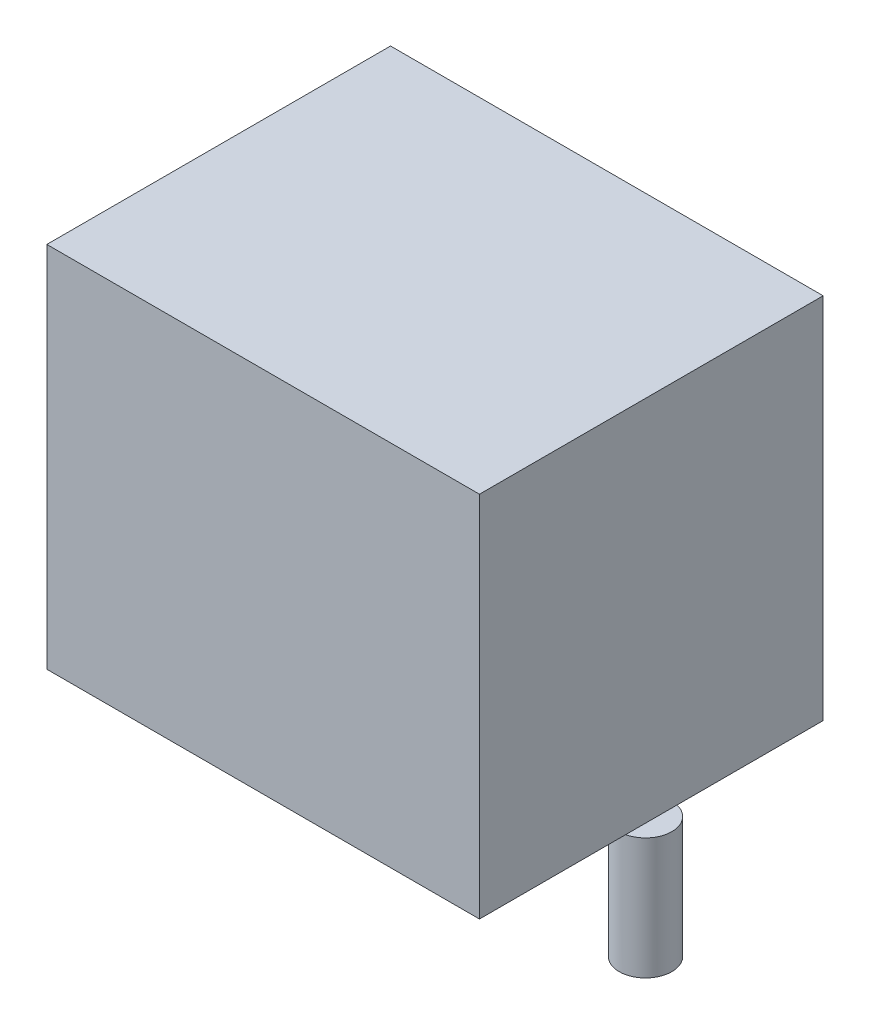
ISO-10303-21;
HEADER;
FILE_DESCRIPTION(('STEP AP214'),'2;1');
FILE_NAME('part.step','',(''),(''),'','','');
FILE_SCHEMA(('AUTOMOTIVE_DESIGN { 1 0 10303 214 1 1 1 1 }'));
ENDSEC;
DATA;
#1=APPLICATION_CONTEXT('core data for automotive mechanical design processes');
#2=APPLICATION_PROTOCOL_DEFINITION('international standard','automotive_design',2000,#1);
#3=PRODUCT_CONTEXT('',#1,'mechanical');
#4=PRODUCT('Part','Part','',(#3));
#5=PRODUCT_RELATED_PRODUCT_CATEGORY('part','',(#4));
#6=PRODUCT_DEFINITION_FORMATION('','',#4);
#7=PRODUCT_DEFINITION_CONTEXT('part definition',#1,'design');
#8=PRODUCT_DEFINITION('design','',#6,#7);
#9=PRODUCT_DEFINITION_SHAPE('','',#8);
#10=(LENGTH_UNIT() NAMED_UNIT(*) SI_UNIT(.MILLI.,.METRE.));
#11=(NAMED_UNIT(*) PLANE_ANGLE_UNIT() SI_UNIT($,.RADIAN.));
#12=(NAMED_UNIT(*) SI_UNIT($,.STERADIAN.) SOLID_ANGLE_UNIT());
#13=UNCERTAINTY_MEASURE_WITH_UNIT(LENGTH_MEASURE(1.E-05),#10,'distance_accuracy_value','');
#14=(GEOMETRIC_REPRESENTATION_CONTEXT(3) GLOBAL_UNCERTAINTY_ASSIGNED_CONTEXT((#13)) GLOBAL_UNIT_ASSIGNED_CONTEXT((#10,
#11,#12)) REPRESENTATION_CONTEXT('',''));
#15=CARTESIAN_POINT('',(0.,0.,0.));
#16=DIRECTION('',(0.,0.,1.));
#17=DIRECTION('',(1.,0.,0.));
#18=AXIS2_PLACEMENT_3D('',#15,#16,#17);
#19=CARTESIAN_POINT('',(-5.207,-3.,0.));
#20=DIRECTION('',(0.,-1.,0.));
#21=DIRECTION('',(0.,0.,-1.));
#22=AXIS2_PLACEMENT_3D('',#19,#20,#21);
#23=PLANE('',#22);
#24=CARTESIAN_POINT('',(-5.207,-3.,0.));
#25=DIRECTION('',(0.,1.,0.));
#26=DIRECTION('',(0.,0.,1.));
#27=AXIS2_PLACEMENT_3D('',#24,#25,#26);
#28=CIRCLE('',#27,0.650000000000002);
#29=CARTESIAN_POINT('',(-5.207,-3.,0.649999999999988));
#30=VERTEX_POINT('',#29);
#31=EDGE_CURVE('E80',#30,#30,#28,.T.);
#32=ORIENTED_EDGE('',*,*,#31,.F.);
#33=EDGE_LOOP('',(#32));
#34=FACE_BOUND('',#33,.T.);
#35=ADVANCED_FACE('F17',(#34),#23,.T.);
#36=CARTESIAN_POINT('',(5.20700000000003,-3.,0.));
#37=DIRECTION('',(0.,-1.,0.));
#38=DIRECTION('',(0.,0.,-1.));
#39=AXIS2_PLACEMENT_3D('',#36,#37,#38);
#40=PLANE('',#39);
#41=CARTESIAN_POINT('',(5.20700000000003,-3.,0.));
#42=DIRECTION('',(0.,1.,0.));
#43=DIRECTION('',(0.,0.,1.));
#44=AXIS2_PLACEMENT_3D('',#41,#42,#43);
#45=CIRCLE('',#44,0.650000000000002);
#46=CARTESIAN_POINT('',(5.20700000000003,-3.,0.650000000000002));
#47=VERTEX_POINT('',#46);
#48=EDGE_CURVE('E125',#47,#47,#45,.T.);
#49=ORIENTED_EDGE('',*,*,#48,.F.);
#50=EDGE_LOOP('',(#49));
#51=FACE_BOUND('',#50,.T.);
#52=ADVANCED_FACE('F159',(#51),#40,.T.);
#53=CARTESIAN_POINT('',(5.20700000000003,0.,0.));
#54=DIRECTION('',(0.,-1.,0.));
#55=DIRECTION('',(0.,0.,-1.));
#56=AXIS2_PLACEMENT_3D('',#53,#54,#55);
#57=PLANE('',#56);
#58=CARTESIAN_POINT('',(5.20700000000003,0.,0.));
#59=DIRECTION('',(0.,1.,0.));
#60=DIRECTION('',(0.,0.,1.));
#61=AXIS2_PLACEMENT_3D('',#58,#59,#60);
#62=CIRCLE('',#61,0.650000000000002);
#63=CARTESIAN_POINT('',(5.35,0.,-0.634074916709383));
#64=VERTEX_POINT('',#63);
#65=CARTESIAN_POINT('',(5.35,0.,0.634074916709376));
#66=VERTEX_POINT('',#65);
#67=EDGE_CURVE('E20',#64,#66,#62,.F.);
#68=ORIENTED_EDGE('',*,*,#67,.F.);
#69=DIRECTION('',(0.,0.,1.));
#70=VECTOR('',#69,1.);
#71=CARTESIAN_POINT('',(5.35000000000001,0.,-4.25000000000001));
#72=LINE('',#71,#70);
#73=EDGE_CURVE('E116',#64,#66,#72,.T.);
#74=ORIENTED_EDGE('',*,*,#73,.T.);
#75=EDGE_LOOP('',(#68,#74));
#76=FACE_BOUND('',#75,.T.);
#77=ADVANCED_FACE('F164',(#76),#57,.F.);
#78=CARTESIAN_POINT('',(-5.207,0.,0.));
#79=DIRECTION('',(0.,-1.,0.));
#80=DIRECTION('',(0.,0.,-1.));
#81=AXIS2_PLACEMENT_3D('',#78,#79,#80);
#82=PLANE('',#81);
#83=DIRECTION('',(0.,0.,-1.));
#84=VECTOR('',#83,1.);
#85=CARTESIAN_POINT('',(-5.35000000000001,0.,-4.25000000000001));
#86=LINE('',#85,#84);
#87=CARTESIAN_POINT('',(-5.35,0.,0.634074916709363));
#88=VERTEX_POINT('',#87);
#89=CARTESIAN_POINT('',(-5.35000000000001,0.,-0.634074916709388));
#90=VERTEX_POINT('',#89);
#91=EDGE_CURVE('E72',#88,#90,#86,.T.);
#92=ORIENTED_EDGE('',*,*,#91,.T.);
#93=CARTESIAN_POINT('',(-5.207,0.,0.));
#94=DIRECTION('',(0.,1.,0.));
#95=DIRECTION('',(0.,0.,1.));
#96=AXIS2_PLACEMENT_3D('',#93,#94,#95);
#97=CIRCLE('',#96,0.650000000000002);
#98=EDGE_CURVE('E74',#88,#90,#97,.F.);
#99=ORIENTED_EDGE('',*,*,#98,.F.);
#100=EDGE_LOOP('',(#92,#99));
#101=FACE_BOUND('',#100,.T.);
#102=ADVANCED_FACE('F81',(#101),#82,.F.);
#103=CARTESIAN_POINT('',(-5.207,-3.,0.));
#104=DIRECTION('',(0.,1.,0.));
#105=DIRECTION('',(0.,0.,1.));
#106=AXIS2_PLACEMENT_3D('',#103,#104,#105);
#107=CYLINDRICAL_SURFACE('',#106,0.650000000000002);
#108=ORIENTED_EDGE('',*,*,#98,.T.);
#109=CARTESIAN_POINT('',(-5.207,0.,0.));
#110=DIRECTION('',(0.,1.,0.));
#111=DIRECTION('',(0.,0.,1.));
#112=AXIS2_PLACEMENT_3D('',#109,#110,#111);
#113=CIRCLE('',#112,0.650000000000002);
#114=EDGE_CURVE('E64',#90,#88,#113,.F.);
#115=ORIENTED_EDGE('',*,*,#114,.T.);
#116=EDGE_LOOP('',(#108,#115));
#117=FACE_BOUND('',#116,.T.);
#118=ORIENTED_EDGE('',*,*,#31,.T.);
#119=EDGE_LOOP('',(#118));
#120=FACE_BOUND('',#119,.T.);
#121=ADVANCED_FACE('F76',(#117,#120),#107,.T.);
#122=CARTESIAN_POINT('',(-5.35000000000001,9.1,4.25));
#123=DIRECTION('',(0.,0.,-1.));
#124=DIRECTION('',(-1.,0.,0.));
#125=AXIS2_PLACEMENT_3D('',#122,#123,#124);
#126=PLANE('',#125);
#127=DIRECTION('',(0.,1.,0.));
#128=VECTOR('',#127,1.);
#129=CARTESIAN_POINT('',(5.35,9.1,4.25));
#130=LINE('',#129,#128);
#131=CARTESIAN_POINT('',(5.35,0.,4.25));
#132=VERTEX_POINT('',#131);
#133=CARTESIAN_POINT('',(5.35,9.1,4.25));
#134=VERTEX_POINT('',#133);
#135=EDGE_CURVE('E119',#132,#134,#130,.T.);
#136=ORIENTED_EDGE('',*,*,#135,.T.);
#137=DIRECTION('',(1.,0.,0.));
#138=VECTOR('',#137,1.);
#139=CARTESIAN_POINT('',(-5.35000000000001,9.1,4.25));
#140=LINE('',#139,#138);
#141=CARTESIAN_POINT('',(-5.35000000000001,9.1,4.25));
#142=VERTEX_POINT('',#141);
#143=EDGE_CURVE('E118',#142,#134,#140,.T.);
#144=ORIENTED_EDGE('',*,*,#143,.F.);
#145=DIRECTION('',(0.,1.,0.));
#146=VECTOR('',#145,1.);
#147=CARTESIAN_POINT('',(-5.35000000000001,9.1,4.25));
#148=LINE('',#147,#146);
#149=CARTESIAN_POINT('',(-5.35,0.,4.25));
#150=VERTEX_POINT('',#149);
#151=EDGE_CURVE('E83',#142,#150,#148,.F.);
#152=ORIENTED_EDGE('',*,*,#151,.T.);
#153=DIRECTION('',(1.,0.,0.));
#154=VECTOR('',#153,1.);
#155=CARTESIAN_POINT('',(-5.35000000000001,0.,4.25));
#156=LINE('',#155,#154);
#157=EDGE_CURVE('E105',#150,#132,#156,.T.);
#158=ORIENTED_EDGE('',*,*,#157,.T.);
#159=EDGE_LOOP('',(#136,#144,#152,#158));
#160=FACE_BOUND('',#159,.T.);
#161=ADVANCED_FACE('F188',(#160),#126,.F.);
#162=CARTESIAN_POINT('',(5.20700000000003,-3.,0.));
#163=DIRECTION('',(0.,1.,0.));
#164=DIRECTION('',(0.,0.,1.));
#165=AXIS2_PLACEMENT_3D('',#162,#163,#164);
#166=CYLINDRICAL_SURFACE('',#165,0.650000000000002);
#167=ORIENTED_EDGE('',*,*,#48,.T.);
#168=EDGE_LOOP('',(#167));
#169=FACE_BOUND('',#168,.T.);
#170=CARTESIAN_POINT('',(5.20700000000003,0.,0.));
#171=DIRECTION('',(0.,1.,0.));
#172=DIRECTION('',(0.,0.,1.));
#173=AXIS2_PLACEMENT_3D('',#170,#171,#172);
#174=CIRCLE('',#173,0.650000000000002);
#175=EDGE_CURVE('E95',#66,#64,#174,.F.);
#176=ORIENTED_EDGE('',*,*,#175,.T.);
#177=ORIENTED_EDGE('',*,*,#67,.T.);
#178=EDGE_LOOP('',(#176,#177));
#179=FACE_BOUND('',#178,.T.);
#180=ADVANCED_FACE('F184',(#169,#179),#166,.T.);
#181=CARTESIAN_POINT('',(5.35000000000001,9.1,-4.25000000000001));
#182=DIRECTION('',(-1.,0.,0.));
#183=DIRECTION('',(0.,0.,1.));
#184=AXIS2_PLACEMENT_3D('',#181,#182,#183);
#185=PLANE('',#184);
#186=ORIENTED_EDGE('',*,*,#73,.F.);
#187=DIRECTION('',(0.,0.,1.));
#188=VECTOR('',#187,1.);
#189=CARTESIAN_POINT('',(5.34999999999999,0.,4.25));
#190=LINE('',#189,#188);
#191=CARTESIAN_POINT('',(5.35,0.,-4.25000000000001));
#192=VERTEX_POINT('',#191);
#193=EDGE_CURVE('E89',#64,#192,#190,.F.);
#194=ORIENTED_EDGE('',*,*,#193,.T.);
#195=DIRECTION('',(0.,1.,0.));
#196=VECTOR('',#195,1.);
#197=CARTESIAN_POINT('',(5.35000000000001,9.1,-4.25000000000001));
#198=LINE('',#197,#196);
#199=CARTESIAN_POINT('',(5.35,9.1,-4.25000000000001));
#200=VERTEX_POINT('',#199);
#201=EDGE_CURVE('E88',#192,#200,#198,.T.);
#202=ORIENTED_EDGE('',*,*,#201,.T.);
#203=DIRECTION('',(0.,0.,1.));
#204=VECTOR('',#203,1.);
#205=CARTESIAN_POINT('',(5.34999999999999,9.1,4.25));
#206=LINE('',#205,#204);
#207=EDGE_CURVE('E138',#134,#200,#206,.F.);
#208=ORIENTED_EDGE('',*,*,#207,.F.);
#209=ORIENTED_EDGE('',*,*,#135,.F.);
#210=DIRECTION('',(0.,0.,1.));
#211=VECTOR('',#210,1.);
#212=CARTESIAN_POINT('',(5.34999999999999,0.,4.25));
#213=LINE('',#212,#211);
#214=EDGE_CURVE('E102',#132,#66,#213,.F.);
#215=ORIENTED_EDGE('',*,*,#214,.T.);
#216=EDGE_LOOP('',(#186,#194,#202,#208,#209,#215));
#217=FACE_BOUND('',#216,.T.);
#218=ADVANCED_FACE('F180',(#217),#185,.F.);
#219=CARTESIAN_POINT('',(-5.35000000000001,9.1,4.25));
#220=DIRECTION('',(0.,1.,0.));
#221=DIRECTION('',(0.,0.,1.));
#222=AXIS2_PLACEMENT_3D('',#219,#220,#221);
#223=PLANE('',#222);
#224=ORIENTED_EDGE('',*,*,#207,.T.);
#225=DIRECTION('',(1.,0.,0.));
#226=VECTOR('',#225,1.);
#227=CARTESIAN_POINT('',(-5.35000000000001,9.1,-4.25000000000001));
#228=LINE('',#227,#226);
#229=CARTESIAN_POINT('',(-5.35000000000001,9.1,-4.25000000000001));
#230=VERTEX_POINT('',#229);
#231=EDGE_CURVE('E92',#200,#230,#228,.F.);
#232=ORIENTED_EDGE('',*,*,#231,.T.);
#233=DIRECTION('',(0.,0.,-1.));
#234=VECTOR('',#233,1.);
#235=CARTESIAN_POINT('',(-5.35000000000001,9.1,-4.25000000000001));
#236=LINE('',#235,#234);
#237=EDGE_CURVE('E133',#230,#142,#236,.F.);
#238=ORIENTED_EDGE('',*,*,#237,.T.);
#239=ORIENTED_EDGE('',*,*,#143,.T.);
#240=EDGE_LOOP('',(#224,#232,#238,#239));
#241=FACE_BOUND('',#240,.T.);
#242=ADVANCED_FACE('F177',(#241),#223,.T.);
#243=CARTESIAN_POINT('',(-5.35000000000001,9.1,-4.25000000000001));
#244=DIRECTION('',(1.,0.,0.));
#245=DIRECTION('',(0.,0.,-1.));
#246=AXIS2_PLACEMENT_3D('',#243,#244,#245);
#247=PLANE('',#246);
#248=ORIENTED_EDGE('',*,*,#91,.F.);
#249=DIRECTION('',(0.,0.,1.));
#250=VECTOR('',#249,1.);
#251=CARTESIAN_POINT('',(-5.34999999999999,0.,4.25));
#252=LINE('',#251,#250);
#253=EDGE_CURVE('E69',#88,#150,#252,.T.);
#254=ORIENTED_EDGE('',*,*,#253,.T.);
#255=ORIENTED_EDGE('',*,*,#151,.F.);
#256=ORIENTED_EDGE('',*,*,#237,.F.);
#257=DIRECTION('',(0.,1.,0.));
#258=VECTOR('',#257,1.);
#259=CARTESIAN_POINT('',(-5.35000000000001,9.1,-4.25000000000001));
#260=LINE('',#259,#258);
#261=CARTESIAN_POINT('',(-5.35000000000001,0.,-4.25000000000001));
#262=VERTEX_POINT('',#261);
#263=EDGE_CURVE('E26',#230,#262,#260,.F.);
#264=ORIENTED_EDGE('',*,*,#263,.T.);
#265=DIRECTION('',(0.,0.,1.));
#266=VECTOR('',#265,1.);
#267=CARTESIAN_POINT('',(-5.35000000000001,0.,4.25));
#268=LINE('',#267,#266);
#269=EDGE_CURVE('E34',#262,#90,#268,.T.);
#270=ORIENTED_EDGE('',*,*,#269,.T.);
#271=EDGE_LOOP('',(#248,#254,#255,#256,#264,#270));
#272=FACE_BOUND('',#271,.T.);
#273=ADVANCED_FACE('F86',(#272),#247,.F.);
#274=CARTESIAN_POINT('',(-5.35000000000001,0.,4.25));
#275=DIRECTION('',(0.,1.,0.));
#276=DIRECTION('',(0.,0.,1.));
#277=AXIS2_PLACEMENT_3D('',#274,#275,#276);
#278=PLANE('',#277);
#279=ORIENTED_EDGE('',*,*,#269,.F.);
#280=DIRECTION('',(1.,0.,0.));
#281=VECTOR('',#280,1.);
#282=CARTESIAN_POINT('',(-5.35000000000001,0.,-4.25000000000001));
#283=LINE('',#282,#281);
#284=EDGE_CURVE('E11',#262,#192,#283,.T.);
#285=ORIENTED_EDGE('',*,*,#284,.T.);
#286=ORIENTED_EDGE('',*,*,#193,.F.);
#287=ORIENTED_EDGE('',*,*,#175,.F.);
#288=ORIENTED_EDGE('',*,*,#214,.F.);
#289=ORIENTED_EDGE('',*,*,#157,.F.);
#290=ORIENTED_EDGE('',*,*,#253,.F.);
#291=ORIENTED_EDGE('',*,*,#114,.F.);
#292=EDGE_LOOP('',(#279,#285,#286,#287,#288,#289,#290,#291));
#293=FACE_BOUND('',#292,.T.);
#294=ADVANCED_FACE('F66',(#293),#278,.F.);
#295=CARTESIAN_POINT('',(-5.35000000000001,9.1,-4.25000000000001));
#296=DIRECTION('',(0.,0.,1.));
#297=DIRECTION('',(1.,0.,0.));
#298=AXIS2_PLACEMENT_3D('',#295,#296,#297);
#299=PLANE('',#298);
#300=ORIENTED_EDGE('',*,*,#263,.F.);
#301=ORIENTED_EDGE('',*,*,#231,.F.);
#302=ORIENTED_EDGE('',*,*,#201,.F.);
#303=ORIENTED_EDGE('',*,*,#284,.F.);
#304=EDGE_LOOP('',(#300,#301,#302,#303));
#305=FACE_BOUND('',#304,.T.);
#306=ADVANCED_FACE('F166',(#305),#299,.F.);
#307=CLOSED_SHELL('',(#35,#52,#77,#102,#121,#161,#180,#218,#242,#273,#294,#306));
#308=MANIFOLD_SOLID_BREP('B1',#307);
#309=ADVANCED_BREP_SHAPE_REPRESENTATION('',(#18,#308),#14);
#310=SHAPE_DEFINITION_REPRESENTATION(#9,#309);
ENDSEC;
END-ISO-10303-21;
